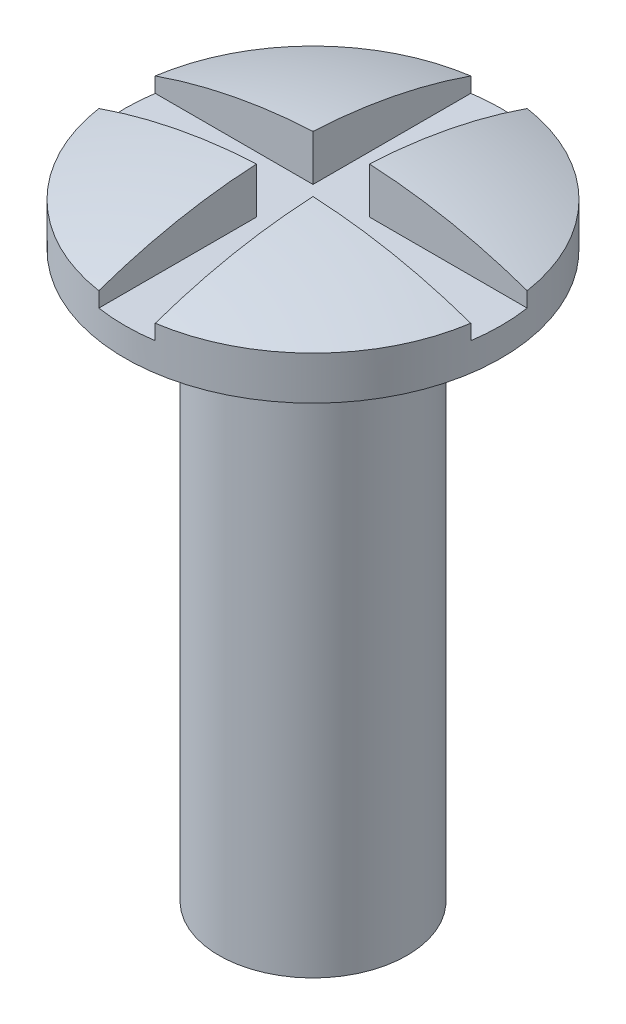
ISO-10303-21;
HEADER;
FILE_DESCRIPTION(('STEP AP214'),'2;1');
FILE_NAME('part.step','',(''),(''),'','','');
FILE_SCHEMA(('AUTOMOTIVE_DESIGN { 1 0 10303 214 1 1 1 1 }'));
ENDSEC;
DATA;
#1=APPLICATION_CONTEXT('core data for automotive mechanical design processes');
#2=APPLICATION_PROTOCOL_DEFINITION('international standard','automotive_design',2000,#1);
#3=PRODUCT_CONTEXT('',#1,'mechanical');
#4=PRODUCT('Part','Part','',(#3));
#5=PRODUCT_RELATED_PRODUCT_CATEGORY('part','',(#4));
#6=PRODUCT_DEFINITION_FORMATION('','',#4);
#7=PRODUCT_DEFINITION_CONTEXT('part definition',#1,'design');
#8=PRODUCT_DEFINITION('design','',#6,#7);
#9=PRODUCT_DEFINITION_SHAPE('','',#8);
#10=(LENGTH_UNIT() NAMED_UNIT(*) SI_UNIT(.MILLI.,.METRE.));
#11=(NAMED_UNIT(*) PLANE_ANGLE_UNIT() SI_UNIT($,.RADIAN.));
#12=(NAMED_UNIT(*) SI_UNIT($,.STERADIAN.) SOLID_ANGLE_UNIT());
#13=UNCERTAINTY_MEASURE_WITH_UNIT(LENGTH_MEASURE(1.E-05),#10,'distance_accuracy_value','');
#14=(GEOMETRIC_REPRESENTATION_CONTEXT(3) GLOBAL_UNCERTAINTY_ASSIGNED_CONTEXT((#13)) GLOBAL_UNIT_ASSIGNED_CONTEXT((#10,
#11,#12)) REPRESENTATION_CONTEXT('',''));
#15=CARTESIAN_POINT('',(0.,0.,0.));
#16=DIRECTION('',(0.,0.,1.));
#17=DIRECTION('',(1.,0.,0.));
#18=AXIS2_PLACEMENT_3D('',#15,#16,#17);
#19=CARTESIAN_POINT('',(0.149999999999999,5.8045546723721,-5.));
#20=DIRECTION('',(1.,0.,0.));
#21=DIRECTION('',(0.,1.,0.));
#22=AXIS2_PLACEMENT_3D('',#19,#20,#21);
#23=PLANE('',#22);
#24=DIRECTION('',(0.,0.,-1.));
#25=VECTOR('',#24,1.);
#26=CARTESIAN_POINT('',(0.149999999999999,3.15,0.15));
#27=LINE('',#26,#25);
#28=CARTESIAN_POINT('',(0.149999999999999,3.15,-0.98868599666426));
#29=VERTEX_POINT('',#28);
#30=CARTESIAN_POINT('',(0.149999999999999,3.15,-0.15));
#31=VERTEX_POINT('',#30);
#32=EDGE_CURVE('E312',#29,#31,#27,.F.);
#33=ORIENTED_EDGE('',*,*,#32,.T.);
#34=DIRECTION('',(0.,1.,0.));
#35=VECTOR('',#34,1.);
#36=CARTESIAN_POINT('',(0.149999999999999,7.59008606997639,-0.15));
#37=LINE('',#36,#35);
#38=CARTESIAN_POINT('',(0.149999999999999,3.39441439013569,-0.15));
#39=VERTEX_POINT('',#38);
#40=EDGE_CURVE('E103',#31,#39,#37,.T.);
#41=ORIENTED_EDGE('',*,*,#40,.T.);
#42=CARTESIAN_POINT('',(0.149999999999999,0.401923788646684,0.));
#43=DIRECTION('',(1.,0.,0.));
#44=DIRECTION('',(0.,0.,-1.));
#45=AXIS2_PLACEMENT_3D('',#42,#43,#44);
#46=CIRCLE('',#45,2.99624765331573);
#47=CARTESIAN_POINT('',(0.149999999999999,3.23035091339287,-0.98868599666426));
#48=VERTEX_POINT('',#47);
#49=EDGE_CURVE('E20',#48,#39,#46,.T.);
#50=ORIENTED_EDGE('',*,*,#49,.F.);
#51=DIRECTION('',(0.,-1.,0.));
#52=VECTOR('',#51,1.);
#53=CARTESIAN_POINT('',(0.149999999999999,2.79579606906158,-0.98868599666426));
#54=LINE('',#53,#52);
#55=EDGE_CURVE('E101',#29,#48,#54,.F.);
#56=ORIENTED_EDGE('',*,*,#55,.F.);
#57=EDGE_LOOP('',(#33,#41,#50,#56));
#58=FACE_BOUND('',#57,.T.);
#59=ADVANCED_FACE('F17',(#58),#23,.F.);
#60=CARTESIAN_POINT('',(0.,0.401923788646684,0.));
#61=DIRECTION('',(1.,0.,0.));
#62=DIRECTION('',(0.,1.,0.));
#63=AXIS2_PLACEMENT_3D('',#60,#61,#62);
#64=SPHERICAL_SURFACE('',#63,3.);
#65=CARTESIAN_POINT('',(0.15,3.39441439013569,-0.149999999999998));
#66=CARTESIAN_POINT('',(0.185844227706884,3.39261797923034,-0.149999999999999));
#67=CARTESIAN_POINT('',(0.221656116184622,3.39017697004741,-0.15));
#68=CARTESIAN_POINT('',(0.293032482809964,3.38402199292905,-0.15));
#69=CARTESIAN_POINT('',(0.328597383467441,3.38031292411375,-0.15));
#70=CARTESIAN_POINT('',(0.399481278711836,3.3716353138384,-0.15));
#71=CARTESIAN_POINT('',(0.434800668856231,3.36667000336254,-0.15));
#72=CARTESIAN_POINT('',(0.505194599749672,3.35548889534369,-0.15));
#73=CARTESIAN_POINT('',(0.540269396049122,3.34927470664494,-0.15));
#74=CARTESIAN_POINT('',(0.610175136903343,3.33559976878448,-0.15));
#75=CARTESIAN_POINT('',(0.645006081458114,3.32813901962276,-0.15));
#76=CARTESIAN_POINT('',(0.714424302374337,3.3119701208357,-0.15));
#77=CARTESIAN_POINT('',(0.749011209204744,3.30326038466298,-0.15));
#78=CARTESIAN_POINT('',(0.817939910649738,3.28458790110519,-0.15));
#79=CARTESIAN_POINT('',(0.852280854165905,3.27462201184872,-0.15));
#80=CARTESIAN_POINT('',(0.920715147770033,3.25342727394359,-0.15));
#81=CARTESIAN_POINT('',(0.954807043138959,3.24219372809523,-0.15));
#82=CARTESIAN_POINT('',(0.988685996664259,3.23035091339287,-0.15));
#83=B_SPLINE_CURVE_WITH_KNOTS('',3,(#65,#66,#67,#68,#69,#70,#71,#72,#73,#74,#75,#76,#77,#78,#79,
#80,#81,#82),.UNSPECIFIED.,.F.,.F.,(4,2,2,2,2,2,2,2,4),(0.,0.10766179406493,0.214912253599918,
0.321889626264574,0.428730060640468,0.535570495016361,0.642547867681017,0.749798327216005,
0.857460121280935),.UNSPECIFIED.);
#84=CARTESIAN_POINT('',(0.988685996664259,3.23035091339287,-0.15));
#85=VERTEX_POINT('',#84);
#86=EDGE_CURVE('E109',#39,#85,#83,.T.);
#87=ORIENTED_EDGE('',*,*,#86,.T.);
#88=CARTESIAN_POINT('',(0.,3.23035091339287,0.));
#89=DIRECTION('',(0.,-1.,0.));
#90=DIRECTION('',(0.,0.,-1.));
#91=AXIS2_PLACEMENT_3D('',#88,#89,#90);
#92=CIRCLE('',#91,1.);
#93=EDGE_CURVE('E107',#48,#85,#92,.T.);
#94=ORIENTED_EDGE('',*,*,#93,.F.);
#95=ORIENTED_EDGE('',*,*,#49,.T.);
#96=EDGE_LOOP('',(#87,#94,#95));
#97=FACE_BOUND('',#96,.T.);
#98=ADVANCED_FACE('F108',(#97),#64,.T.);
#99=CARTESIAN_POINT('',(-5.,7.59008606997639,-0.15));
#100=DIRECTION('',(0.,0.,-1.));
#101=DIRECTION('',(0.,1.,0.));
#102=AXIS2_PLACEMENT_3D('',#99,#100,#101);
#103=PLANE('',#102);
#104=ORIENTED_EDGE('',*,*,#40,.F.);
#105=DIRECTION('',(1.,0.,0.));
#106=VECTOR('',#105,1.);
#107=CARTESIAN_POINT('',(-5.,3.15,-0.15));
#108=LINE('',#107,#106);
#109=CARTESIAN_POINT('',(0.988685996664259,3.15,-0.15));
#110=VERTEX_POINT('',#109);
#111=EDGE_CURVE('E302',#31,#110,#108,.T.);
#112=ORIENTED_EDGE('',*,*,#111,.T.);
#113=DIRECTION('',(0.,-1.,0.));
#114=VECTOR('',#113,1.);
#115=CARTESIAN_POINT('',(0.988685996664259,2.79579606906158,-0.15));
#116=LINE('',#115,#114);
#117=EDGE_CURVE('E113',#85,#110,#116,.T.);
#118=ORIENTED_EDGE('',*,*,#117,.F.);
#119=ORIENTED_EDGE('',*,*,#86,.F.);
#120=EDGE_LOOP('',(#104,#112,#118,#119));
#121=FACE_BOUND('',#120,.T.);
#122=ADVANCED_FACE('F248',(#121),#103,.F.);
#123=CARTESIAN_POINT('',(-5.,7.59008606997639,0.15));
#124=DIRECTION('',(0.,0.,1.));
#125=DIRECTION('',(0.,-1.,0.));
#126=AXIS2_PLACEMENT_3D('',#123,#124,#125);
#127=PLANE('',#126);
#128=DIRECTION('',(0.,1.,0.));
#129=VECTOR('',#128,1.);
#130=CARTESIAN_POINT('',(0.149999999999999,5.8045546723721,0.15));
#131=LINE('',#130,#129);
#132=CARTESIAN_POINT('',(0.149999999999999,3.15,0.15));
#133=VERTEX_POINT('',#132);
#134=CARTESIAN_POINT('',(0.149999999999999,3.39441439013569,0.15));
#135=VERTEX_POINT('',#134);
#136=EDGE_CURVE('E240',#133,#135,#131,.T.);
#137=ORIENTED_EDGE('',*,*,#136,.T.);
#138=CARTESIAN_POINT('',(0.988685996664259,3.23035091339287,0.15));
#139=CARTESIAN_POINT('',(0.954807043138959,3.24219372809523,0.15));
#140=CARTESIAN_POINT('',(0.920715147770033,3.25342727394359,0.15));
#141=CARTESIAN_POINT('',(0.852280854165905,3.27462201184871,0.15));
#142=CARTESIAN_POINT('',(0.817939910649738,3.28458790110519,0.15));
#143=CARTESIAN_POINT('',(0.749011209204744,3.30326038466298,0.15));
#144=CARTESIAN_POINT('',(0.714424302374337,3.3119701208357,0.15));
#145=CARTESIAN_POINT('',(0.645006081458114,3.32813901962276,0.15));
#146=CARTESIAN_POINT('',(0.610175136903343,3.33559976878448,0.15));
#147=CARTESIAN_POINT('',(0.540269396049122,3.34927470664494,0.15));
#148=CARTESIAN_POINT('',(0.505194599749672,3.35548889534369,0.15));
#149=CARTESIAN_POINT('',(0.434800668856231,3.36667000336254,0.15));
#150=CARTESIAN_POINT('',(0.399481278711835,3.3716353138384,0.15));
#151=CARTESIAN_POINT('',(0.328597383467441,3.38031292411375,0.15));
#152=CARTESIAN_POINT('',(0.293032482809964,3.38402199292905,0.15));
#153=CARTESIAN_POINT('',(0.221656116184622,3.39017697004741,0.15));
#154=CARTESIAN_POINT('',(0.185844227706884,3.39261797923034,0.15));
#155=CARTESIAN_POINT('',(0.15,3.39441439013569,0.15));
#156=B_SPLINE_CURVE_WITH_KNOTS('',3,(#138,#139,#140,#141,#142,#143,#144,#145,#146,#147,#148,
#149,#150,#151,#152,#153,#154,#155),.UNSPECIFIED.,.F.,.F.,(4,2,2,2,2,2,2,2,4),(0.,
0.10766179406493,0.214912253599918,0.321889626264574,0.428730060640467,0.535570495016361,
0.642547867681017,0.749798327216005,0.857460121280935),.UNSPECIFIED.);
#157=CARTESIAN_POINT('',(0.988685996664259,3.23035091339287,0.15));
#158=VERTEX_POINT('',#157);
#159=EDGE_CURVE('E238',#158,#135,#156,.T.);
#160=ORIENTED_EDGE('',*,*,#159,.F.);
#161=DIRECTION('',(0.,-1.,0.));
#162=VECTOR('',#161,1.);
#163=CARTESIAN_POINT('',(0.98868599666426,2.79579606906158,0.15));
#164=LINE('',#163,#162);
#165=CARTESIAN_POINT('',(0.988685996664259,3.15,0.15));
#166=VERTEX_POINT('',#165);
#167=EDGE_CURVE('E155',#166,#158,#164,.F.);
#168=ORIENTED_EDGE('',*,*,#167,.F.);
#169=DIRECTION('',(1.,0.,0.));
#170=VECTOR('',#169,1.);
#171=CARTESIAN_POINT('',(-5.,3.15,0.15));
#172=LINE('',#171,#170);
#173=EDGE_CURVE('E299',#166,#133,#172,.F.);
#174=ORIENTED_EDGE('',*,*,#173,.T.);
#175=EDGE_LOOP('',(#137,#160,#168,#174));
#176=FACE_BOUND('',#175,.T.);
#177=ADVANCED_FACE('F225',(#176),#127,.F.);
#178=CARTESIAN_POINT('',(0.,0.401923788646684,0.));
#179=DIRECTION('',(1.,0.,0.));
#180=DIRECTION('',(0.,1.,0.));
#181=AXIS2_PLACEMENT_3D('',#178,#179,#180);
#182=SPHERICAL_SURFACE('',#181,3.);
#183=CARTESIAN_POINT('',(0.,3.23035091339287,0.));
#184=DIRECTION('',(0.,-1.,0.));
#185=DIRECTION('',(0.,0.,-1.));
#186=AXIS2_PLACEMENT_3D('',#183,#184,#185);
#187=CIRCLE('',#186,1.);
#188=CARTESIAN_POINT('',(0.149999999999999,3.23035091339287,0.98868599666426));
#189=VERTEX_POINT('',#188);
#190=EDGE_CURVE('E152',#158,#189,#187,.T.);
#191=ORIENTED_EDGE('',*,*,#190,.F.);
#192=ORIENTED_EDGE('',*,*,#159,.T.);
#193=CARTESIAN_POINT('',(0.149999999999999,0.401923788646684,0.));
#194=DIRECTION('',(1.,0.,0.));
#195=DIRECTION('',(0.,0.,-1.));
#196=AXIS2_PLACEMENT_3D('',#193,#194,#195);
#197=CIRCLE('',#196,2.99624765331573);
#198=EDGE_CURVE('E297',#135,#189,#197,.T.);
#199=ORIENTED_EDGE('',*,*,#198,.T.);
#200=EDGE_LOOP('',(#191,#192,#199));
#201=FACE_BOUND('',#200,.T.);
#202=ADVANCED_FACE('F219',(#201),#182,.T.);
#203=CARTESIAN_POINT('',(0.149999999999999,5.8045546723721,-5.));
#204=DIRECTION('',(1.,0.,0.));
#205=DIRECTION('',(0.,1.,0.));
#206=AXIS2_PLACEMENT_3D('',#203,#204,#205);
#207=PLANE('',#206);
#208=ORIENTED_EDGE('',*,*,#198,.F.);
#209=ORIENTED_EDGE('',*,*,#136,.F.);
#210=DIRECTION('',(0.,0.,-1.));
#211=VECTOR('',#210,1.);
#212=CARTESIAN_POINT('',(0.149999999999999,3.15,0.15));
#213=LINE('',#212,#211);
#214=CARTESIAN_POINT('',(0.149999999999999,3.15,0.98868599666426));
#215=VERTEX_POINT('',#214);
#216=EDGE_CURVE('E288',#133,#215,#213,.F.);
#217=ORIENTED_EDGE('',*,*,#216,.T.);
#218=DIRECTION('',(0.,-1.,0.));
#219=VECTOR('',#218,1.);
#220=CARTESIAN_POINT('',(0.149999999999999,2.79579606906158,0.98868599666426));
#221=LINE('',#220,#219);
#222=EDGE_CURVE('E151',#189,#215,#221,.T.);
#223=ORIENTED_EDGE('',*,*,#222,.F.);
#224=EDGE_LOOP('',(#208,#209,#217,#223));
#225=FACE_BOUND('',#224,.T.);
#226=ADVANCED_FACE('F215',(#225),#207,.F.);
#227=CARTESIAN_POINT('',(-0.150000000000001,5.8045546723721,-5.));
#228=DIRECTION('',(-1.,0.,0.));
#229=DIRECTION('',(0.,-1.,0.));
#230=AXIS2_PLACEMENT_3D('',#227,#228,#229);
#231=PLANE('',#230);
#232=DIRECTION('',(0.,0.,-1.));
#233=VECTOR('',#232,1.);
#234=CARTESIAN_POINT('',(-0.150000000000001,3.15,0.15));
#235=LINE('',#234,#233);
#236=CARTESIAN_POINT('',(-0.150000000000001,3.15,0.988685996664259));
#237=VERTEX_POINT('',#236);
#238=CARTESIAN_POINT('',(-0.150000000000001,3.15,0.15));
#239=VERTEX_POINT('',#238);
#240=EDGE_CURVE('E123',#237,#239,#235,.T.);
#241=ORIENTED_EDGE('',*,*,#240,.T.);
#242=DIRECTION('',(0.,-1.,0.));
#243=VECTOR('',#242,1.);
#244=CARTESIAN_POINT('',(-0.15,7.59008606997639,0.15));
#245=LINE('',#244,#243);
#246=CARTESIAN_POINT('',(-0.15,3.39441439013569,0.15));
#247=VERTEX_POINT('',#246);
#248=EDGE_CURVE('E197',#239,#247,#245,.F.);
#249=ORIENTED_EDGE('',*,*,#248,.T.);
#250=CARTESIAN_POINT('',(-0.150000000000001,0.401923788646684,0.));
#251=DIRECTION('',(1.,0.,0.));
#252=DIRECTION('',(0.,0.,-1.));
#253=AXIS2_PLACEMENT_3D('',#250,#251,#252);
#254=CIRCLE('',#253,2.99624765331573);
#255=CARTESIAN_POINT('',(-0.150000000000001,3.23035091339287,0.98868599666426));
#256=VERTEX_POINT('',#255);
#257=EDGE_CURVE('E199',#256,#247,#254,.F.);
#258=ORIENTED_EDGE('',*,*,#257,.F.);
#259=DIRECTION('',(0.,-1.,0.));
#260=VECTOR('',#259,1.);
#261=CARTESIAN_POINT('',(-0.150000000000001,2.79579606906158,0.988685996664259));
#262=LINE('',#261,#260);
#263=EDGE_CURVE('E147',#237,#256,#262,.F.);
#264=ORIENTED_EDGE('',*,*,#263,.F.);
#265=EDGE_LOOP('',(#241,#249,#258,#264));
#266=FACE_BOUND('',#265,.T.);
#267=ADVANCED_FACE('F210',(#266),#231,.F.);
#268=CARTESIAN_POINT('',(0.,0.401923788646684,0.));
#269=DIRECTION('',(1.,0.,0.));
#270=DIRECTION('',(0.,1.,0.));
#271=AXIS2_PLACEMENT_3D('',#268,#269,#270);
#272=SPHERICAL_SURFACE('',#271,3.);
#273=CARTESIAN_POINT('',(-0.150000000000001,3.39441439013569,0.15));
#274=CARTESIAN_POINT('',(-0.185844227706885,3.39261797923034,0.15));
#275=CARTESIAN_POINT('',(-0.221656116184622,3.39017697004741,0.15));
#276=CARTESIAN_POINT('',(-0.293032482809964,3.38402199292905,0.15));
#277=CARTESIAN_POINT('',(-0.328597383467442,3.38031292411375,0.15));
#278=CARTESIAN_POINT('',(-0.399481278711836,3.3716353138384,0.15));
#279=CARTESIAN_POINT('',(-0.434800668856232,3.36667000336254,0.15));
#280=CARTESIAN_POINT('',(-0.505194599749672,3.35548889534369,0.15));
#281=CARTESIAN_POINT('',(-0.540269396049122,3.34927470664494,0.15));
#282=CARTESIAN_POINT('',(-0.610175136903343,3.33559976878448,0.15));
#283=CARTESIAN_POINT('',(-0.645006081458114,3.32813901962276,0.15));
#284=CARTESIAN_POINT('',(-0.714424302374337,3.3119701208357,0.15));
#285=CARTESIAN_POINT('',(-0.749011209204744,3.30326038466298,0.15));
#286=CARTESIAN_POINT('',(-0.817939910649738,3.28458790110519,0.15));
#287=CARTESIAN_POINT('',(-0.852280854165905,3.27462201184872,0.15));
#288=CARTESIAN_POINT('',(-0.920715147770033,3.25342727394359,0.15));
#289=CARTESIAN_POINT('',(-0.954807043138959,3.24219372809523,0.15));
#290=CARTESIAN_POINT('',(-0.988685996664259,3.23035091339287,0.15));
#291=B_SPLINE_CURVE_WITH_KNOTS('',3,(#273,#274,#275,#276,#277,#278,#279,#280,#281,#282,#283,
#284,#285,#286,#287,#288,#289,#290),.UNSPECIFIED.,.F.,.F.,(4,2,2,2,2,2,2,2,4),(0.,
0.10766179406493,0.214912253599918,0.321889626264573,0.428730060640467,0.535570495016361,
0.642547867681016,0.749798327216004,0.857460121280934),.UNSPECIFIED.);
#292=CARTESIAN_POINT('',(-0.988685996664259,3.23035091339287,0.15));
#293=VERTEX_POINT('',#292);
#294=EDGE_CURVE('E171',#247,#293,#291,.T.);
#295=ORIENTED_EDGE('',*,*,#294,.T.);
#296=CARTESIAN_POINT('',(0.,3.23035091339287,0.));
#297=DIRECTION('',(0.,-1.,0.));
#298=DIRECTION('',(0.,0.,-1.));
#299=AXIS2_PLACEMENT_3D('',#296,#297,#298);
#300=CIRCLE('',#299,1.);
#301=EDGE_CURVE('E144',#256,#293,#300,.T.);
#302=ORIENTED_EDGE('',*,*,#301,.F.);
#303=ORIENTED_EDGE('',*,*,#257,.T.);
#304=EDGE_LOOP('',(#295,#302,#303));
#305=FACE_BOUND('',#304,.T.);
#306=ADVANCED_FACE('F205',(#305),#272,.T.);
#307=CARTESIAN_POINT('',(-5.,7.59008606997639,0.15));
#308=DIRECTION('',(0.,0.,1.));
#309=DIRECTION('',(0.,-1.,0.));
#310=AXIS2_PLACEMENT_3D('',#307,#308,#309);
#311=PLANE('',#310);
#312=ORIENTED_EDGE('',*,*,#248,.F.);
#313=DIRECTION('',(1.,0.,0.));
#314=VECTOR('',#313,1.);
#315=CARTESIAN_POINT('',(-5.,3.15,0.15));
#316=LINE('',#315,#314);
#317=CARTESIAN_POINT('',(-0.988685996664259,3.15,0.15));
#318=VERTEX_POINT('',#317);
#319=EDGE_CURVE('E121',#239,#318,#316,.F.);
#320=ORIENTED_EDGE('',*,*,#319,.T.);
#321=DIRECTION('',(0.,-1.,0.));
#322=VECTOR('',#321,1.);
#323=CARTESIAN_POINT('',(-0.988685996664259,2.79579606906158,0.150000000000001));
#324=LINE('',#323,#322);
#325=EDGE_CURVE('E143',#293,#318,#324,.T.);
#326=ORIENTED_EDGE('',*,*,#325,.F.);
#327=ORIENTED_EDGE('',*,*,#294,.F.);
#328=EDGE_LOOP('',(#312,#320,#326,#327));
#329=FACE_BOUND('',#328,.T.);
#330=ADVANCED_FACE('F209',(#329),#311,.F.);
#331=CARTESIAN_POINT('',(-5.,7.59008606997639,-0.15));
#332=DIRECTION('',(0.,0.,-1.));
#333=DIRECTION('',(0.,1.,0.));
#334=AXIS2_PLACEMENT_3D('',#331,#332,#333);
#335=PLANE('',#334);
#336=DIRECTION('',(0.,-1.,0.));
#337=VECTOR('',#336,1.);
#338=CARTESIAN_POINT('',(-0.150000000000001,5.8045546723721,-0.15));
#339=LINE('',#338,#337);
#340=CARTESIAN_POINT('',(-0.150000000000001,3.15,-0.15));
#341=VERTEX_POINT('',#340);
#342=CARTESIAN_POINT('',(-0.150000000000001,3.39441439013569,-0.149999999999999));
#343=VERTEX_POINT('',#342);
#344=EDGE_CURVE('E162',#341,#343,#339,.F.);
#345=ORIENTED_EDGE('',*,*,#344,.T.);
#346=CARTESIAN_POINT('',(-0.988685996664259,3.23035091339287,-0.15));
#347=CARTESIAN_POINT('',(-0.954807043138959,3.24219372809523,-0.15));
#348=CARTESIAN_POINT('',(-0.920715147770033,3.25342727394359,-0.15));
#349=CARTESIAN_POINT('',(-0.852280854165905,3.27462201184872,-0.15));
#350=CARTESIAN_POINT('',(-0.817939910649738,3.28458790110519,-0.15));
#351=CARTESIAN_POINT('',(-0.749011209204744,3.30326038466298,-0.15));
#352=CARTESIAN_POINT('',(-0.714424302374337,3.3119701208357,-0.15));
#353=CARTESIAN_POINT('',(-0.645006081458114,3.32813901962276,-0.15));
#354=CARTESIAN_POINT('',(-0.610175136903343,3.33559976878448,-0.15));
#355=CARTESIAN_POINT('',(-0.540269396049122,3.34927470664494,-0.15));
#356=CARTESIAN_POINT('',(-0.505194599749672,3.35548889534369,-0.15));
#357=CARTESIAN_POINT('',(-0.434800668856232,3.36667000336254,-0.15));
#358=CARTESIAN_POINT('',(-0.399481278711836,3.3716353138384,-0.15));
#359=CARTESIAN_POINT('',(-0.328597383467442,3.38031292411375,-0.15));
#360=CARTESIAN_POINT('',(-0.293032482809964,3.38402199292905,-0.15));
#361=CARTESIAN_POINT('',(-0.221656116184622,3.39017697004741,-0.15));
#362=CARTESIAN_POINT('',(-0.185844227706885,3.39261797923034,-0.149999999999999));
#363=CARTESIAN_POINT('',(-0.150000000000001,3.39441439013569,-0.149999999999998));
#364=B_SPLINE_CURVE_WITH_KNOTS('',3,(#346,#347,#348,#349,#350,#351,#352,#353,#354,#355,#356,
#357,#358,#359,#360,#361,#362,#363),.UNSPECIFIED.,.F.,.F.,(4,2,2,2,2,2,2,2,4),(0.,
0.10766179406493,0.214912253599918,0.321889626264573,0.428730060640467,0.535570495016361,
0.642547867681016,0.749798327216004,0.857460121280934),.UNSPECIFIED.);
#365=CARTESIAN_POINT('',(-0.988685996664259,3.23035091339287,-0.15));
#366=VERTEX_POINT('',#365);
#367=EDGE_CURVE('E163',#366,#343,#364,.T.);
#368=ORIENTED_EDGE('',*,*,#367,.F.);
#369=DIRECTION('',(0.,-1.,0.));
#370=VECTOR('',#369,1.);
#371=CARTESIAN_POINT('',(-0.988685996664259,2.79579606906158,-0.15));
#372=LINE('',#371,#370);
#373=CARTESIAN_POINT('',(-0.988685996664259,3.15,-0.15));
#374=VERTEX_POINT('',#373);
#375=EDGE_CURVE('E139',#374,#366,#372,.F.);
#376=ORIENTED_EDGE('',*,*,#375,.F.);
#377=DIRECTION('',(1.,0.,0.));
#378=VECTOR('',#377,1.);
#379=CARTESIAN_POINT('',(-5.,3.15,-0.15));
#380=LINE('',#379,#378);
#381=EDGE_CURVE('E161',#374,#341,#380,.T.);
#382=ORIENTED_EDGE('',*,*,#381,.T.);
#383=EDGE_LOOP('',(#345,#368,#376,#382));
#384=FACE_BOUND('',#383,.T.);
#385=ADVANCED_FACE('F178',(#384),#335,.F.);
#386=CARTESIAN_POINT('',(0.,0.401923788646684,0.));
#387=DIRECTION('',(1.,0.,0.));
#388=DIRECTION('',(0.,1.,0.));
#389=AXIS2_PLACEMENT_3D('',#386,#387,#388);
#390=SPHERICAL_SURFACE('',#389,3.);
#391=CARTESIAN_POINT('',(0.,3.23035091339287,0.));
#392=DIRECTION('',(0.,-1.,0.));
#393=DIRECTION('',(0.,0.,-1.));
#394=AXIS2_PLACEMENT_3D('',#391,#392,#393);
#395=CIRCLE('',#394,1.);
#396=CARTESIAN_POINT('',(-0.150000000000001,3.23035091339287,-0.98868599666426));
#397=VERTEX_POINT('',#396);
#398=EDGE_CURVE('E136',#366,#397,#395,.T.);
#399=ORIENTED_EDGE('',*,*,#398,.F.);
#400=ORIENTED_EDGE('',*,*,#367,.T.);
#401=CARTESIAN_POINT('',(-0.150000000000001,0.401923788646684,0.));
#402=DIRECTION('',(1.,0.,0.));
#403=DIRECTION('',(0.,0.,-1.));
#404=AXIS2_PLACEMENT_3D('',#401,#402,#403);
#405=CIRCLE('',#404,2.99624765331573);
#406=EDGE_CURVE('E159',#343,#397,#405,.F.);
#407=ORIENTED_EDGE('',*,*,#406,.T.);
#408=EDGE_LOOP('',(#399,#400,#407));
#409=FACE_BOUND('',#408,.T.);
#410=ADVANCED_FACE('F180',(#409),#390,.T.);
#411=CARTESIAN_POINT('',(-0.150000000000001,5.8045546723721,-5.));
#412=DIRECTION('',(-1.,0.,0.));
#413=DIRECTION('',(0.,-1.,0.));
#414=AXIS2_PLACEMENT_3D('',#411,#412,#413);
#415=PLANE('',#414);
#416=ORIENTED_EDGE('',*,*,#406,.F.);
#417=ORIENTED_EDGE('',*,*,#344,.F.);
#418=DIRECTION('',(0.,0.,-1.));
#419=VECTOR('',#418,1.);
#420=CARTESIAN_POINT('',(-0.150000000000001,3.15,0.15));
#421=LINE('',#420,#419);
#422=CARTESIAN_POINT('',(-0.150000000000001,3.15,-0.988685996664259));
#423=VERTEX_POINT('',#422);
#424=EDGE_CURVE('E35',#341,#423,#421,.T.);
#425=ORIENTED_EDGE('',*,*,#424,.T.);
#426=DIRECTION('',(0.,-1.,0.));
#427=VECTOR('',#426,1.);
#428=CARTESIAN_POINT('',(-0.150000000000001,2.79579606906158,-0.988685996664259));
#429=LINE('',#428,#427);
#430=EDGE_CURVE('E135',#397,#423,#429,.T.);
#431=ORIENTED_EDGE('',*,*,#430,.F.);
#432=EDGE_LOOP('',(#416,#417,#425,#431));
#433=FACE_BOUND('',#432,.T.);
#434=ADVANCED_FACE('F185',(#433),#415,.F.);
#435=CARTESIAN_POINT('',(-5.,3.15,0.15));
#436=DIRECTION('',(0.,-1.,0.));
#437=DIRECTION('',(0.,0.,-1.));
#438=AXIS2_PLACEMENT_3D('',#435,#436,#437);
#439=PLANE('',#438);
#440=ORIENTED_EDGE('',*,*,#240,.F.);
#441=CARTESIAN_POINT('',(0.,3.15,0.));
#442=DIRECTION('',(0.,-1.,0.));
#443=DIRECTION('',(0.,0.,-1.));
#444=AXIS2_PLACEMENT_3D('',#441,#442,#443);
#445=CIRCLE('',#444,1.);
#446=EDGE_CURVE('E148',#215,#237,#445,.T.);
#447=ORIENTED_EDGE('',*,*,#446,.F.);
#448=ORIENTED_EDGE('',*,*,#216,.F.);
#449=ORIENTED_EDGE('',*,*,#173,.F.);
#450=CARTESIAN_POINT('',(0.,3.15,0.));
#451=DIRECTION('',(0.,-1.,0.));
#452=DIRECTION('',(0.,0.,-1.));
#453=AXIS2_PLACEMENT_3D('',#450,#451,#452);
#454=CIRCLE('',#453,1.);
#455=EDGE_CURVE('E156',#110,#166,#454,.T.);
#456=ORIENTED_EDGE('',*,*,#455,.F.);
#457=ORIENTED_EDGE('',*,*,#111,.F.);
#458=ORIENTED_EDGE('',*,*,#32,.F.);
#459=CARTESIAN_POINT('',(0.,3.15,0.));
#460=DIRECTION('',(0.,-1.,0.));
#461=DIRECTION('',(0.,0.,-1.));
#462=AXIS2_PLACEMENT_3D('',#459,#460,#461);
#463=CIRCLE('',#462,1.);
#464=EDGE_CURVE('E119',#423,#29,#463,.T.);
#465=ORIENTED_EDGE('',*,*,#464,.F.);
#466=ORIENTED_EDGE('',*,*,#424,.F.);
#467=ORIENTED_EDGE('',*,*,#381,.F.);
#468=CARTESIAN_POINT('',(0.,3.15,0.));
#469=DIRECTION('',(0.,-1.,0.));
#470=DIRECTION('',(0.,0.,-1.));
#471=AXIS2_PLACEMENT_3D('',#468,#469,#470);
#472=CIRCLE('',#471,1.);
#473=EDGE_CURVE('E140',#318,#374,#472,.T.);
#474=ORIENTED_EDGE('',*,*,#473,.F.);
#475=ORIENTED_EDGE('',*,*,#319,.F.);
#476=EDGE_LOOP('',(#440,#447,#448,#449,#456,#457,#458,#465,#466,#467,#474,#475));
#477=FACE_BOUND('',#476,.T.);
#478=ADVANCED_FACE('F275',(#477),#439,.F.);
#479=CARTESIAN_POINT('',(0.,2.79579606906158,0.));
#480=DIRECTION('',(0.,-1.,0.));
#481=DIRECTION('',(0.,0.,-1.));
#482=AXIS2_PLACEMENT_3D('',#479,#480,#481);
#483=CYLINDRICAL_SURFACE('',#482,1.);
#484=ORIENTED_EDGE('',*,*,#222,.T.);
#485=ORIENTED_EDGE('',*,*,#446,.T.);
#486=ORIENTED_EDGE('',*,*,#263,.T.);
#487=ORIENTED_EDGE('',*,*,#301,.T.);
#488=ORIENTED_EDGE('',*,*,#325,.T.);
#489=ORIENTED_EDGE('',*,*,#473,.T.);
#490=ORIENTED_EDGE('',*,*,#375,.T.);
#491=ORIENTED_EDGE('',*,*,#398,.T.);
#492=ORIENTED_EDGE('',*,*,#430,.T.);
#493=ORIENTED_EDGE('',*,*,#464,.T.);
#494=ORIENTED_EDGE('',*,*,#55,.T.);
#495=ORIENTED_EDGE('',*,*,#93,.T.);
#496=ORIENTED_EDGE('',*,*,#117,.T.);
#497=ORIENTED_EDGE('',*,*,#455,.T.);
#498=ORIENTED_EDGE('',*,*,#167,.T.);
#499=ORIENTED_EDGE('',*,*,#190,.T.);
#500=EDGE_LOOP('',(#484,#485,#486,#487,#488,#489,#490,#491,#492,#493,#494,#495,#496,#497,#498,#499));
#501=FACE_BOUND('',#500,.T.);
#502=CARTESIAN_POINT('',(0.,3.,0.));
#503=DIRECTION('',(0.,-1.,0.));
#504=DIRECTION('',(0.,0.,-1.));
#505=AXIS2_PLACEMENT_3D('',#502,#503,#504);
#506=CIRCLE('',#505,1.);
#507=CARTESIAN_POINT('',(0.,3.,-1.));
#508=VERTEX_POINT('',#507);
#509=EDGE_CURVE('E131',#508,#508,#506,.T.);
#510=ORIENTED_EDGE('',*,*,#509,.F.);
#511=EDGE_LOOP('',(#510));
#512=FACE_BOUND('',#511,.T.);
#513=ADVANCED_FACE('F116',(#501,#512),#483,.T.);
#514=CARTESIAN_POINT('',(0.5,3.,0.));
#515=DIRECTION('',(0.,-1.,0.));
#516=DIRECTION('',(0.,0.,-1.));
#517=AXIS2_PLACEMENT_3D('',#514,#515,#516);
#518=PLANE('',#517);
#519=CARTESIAN_POINT('',(0.,3.,0.));
#520=DIRECTION('',(0.,-1.,0.));
#521=DIRECTION('',(0.,0.,-1.));
#522=AXIS2_PLACEMENT_3D('',#519,#520,#521);
#523=CIRCLE('',#522,0.5);
#524=CARTESIAN_POINT('',(0.,3.,-0.5));
#525=VERTEX_POINT('',#524);
#526=EDGE_CURVE('E26',#525,#525,#523,.T.);
#527=ORIENTED_EDGE('',*,*,#526,.F.);
#528=EDGE_LOOP('',(#527));
#529=FACE_BOUND('',#528,.T.);
#530=ORIENTED_EDGE('',*,*,#509,.T.);
#531=EDGE_LOOP('',(#530));
#532=FACE_BOUND('',#531,.T.);
#533=ADVANCED_FACE('F266',(#529,#532),#518,.T.);
#534=CARTESIAN_POINT('',(0.,0.,0.));
#535=DIRECTION('',(0.,-1.,0.));
#536=DIRECTION('',(0.,0.,-1.));
#537=AXIS2_PLACEMENT_3D('',#534,#535,#536);
#538=PLANE('',#537);
#539=CARTESIAN_POINT('',(0.,0.,0.));
#540=DIRECTION('',(0.,-1.,0.));
#541=DIRECTION('',(0.,0.,-1.));
#542=AXIS2_PLACEMENT_3D('',#539,#540,#541);
#543=CIRCLE('',#542,0.5);
#544=CARTESIAN_POINT('',(0.,0.,-0.5));
#545=VERTEX_POINT('',#544);
#546=EDGE_CURVE('E11',#545,#545,#543,.F.);
#547=ORIENTED_EDGE('',*,*,#546,.F.);
#548=EDGE_LOOP('',(#547));
#549=FACE_BOUND('',#548,.T.);
#550=ADVANCED_FACE('F260',(#549),#538,.T.);
#551=CARTESIAN_POINT('',(0.,2.79579606906158,0.));
#552=DIRECTION('',(0.,-1.,0.));
#553=DIRECTION('',(0.,0.,-1.));
#554=AXIS2_PLACEMENT_3D('',#551,#552,#553);
#555=CYLINDRICAL_SURFACE('',#554,0.5);
#556=ORIENTED_EDGE('',*,*,#546,.T.);
#557=EDGE_LOOP('',(#556));
#558=FACE_BOUND('',#557,.T.);
#559=ORIENTED_EDGE('',*,*,#526,.T.);
#560=EDGE_LOOP('',(#559));
#561=FACE_BOUND('',#560,.T.);
#562=ADVANCED_FACE('F258',(#558,#561),#555,.T.);
#563=CLOSED_SHELL('',(#59,#98,#122,#177,#202,#226,#267,#306,#330,#385,#410,#434,#478,#513,#533,
#550,#562));
#564=MANIFOLD_SOLID_BREP('B1',#563);
#565=ADVANCED_BREP_SHAPE_REPRESENTATION('',(#18,#564),#14);
#566=SHAPE_DEFINITION_REPRESENTATION(#9,#565);
ENDSEC;
END-ISO-10303-21;
